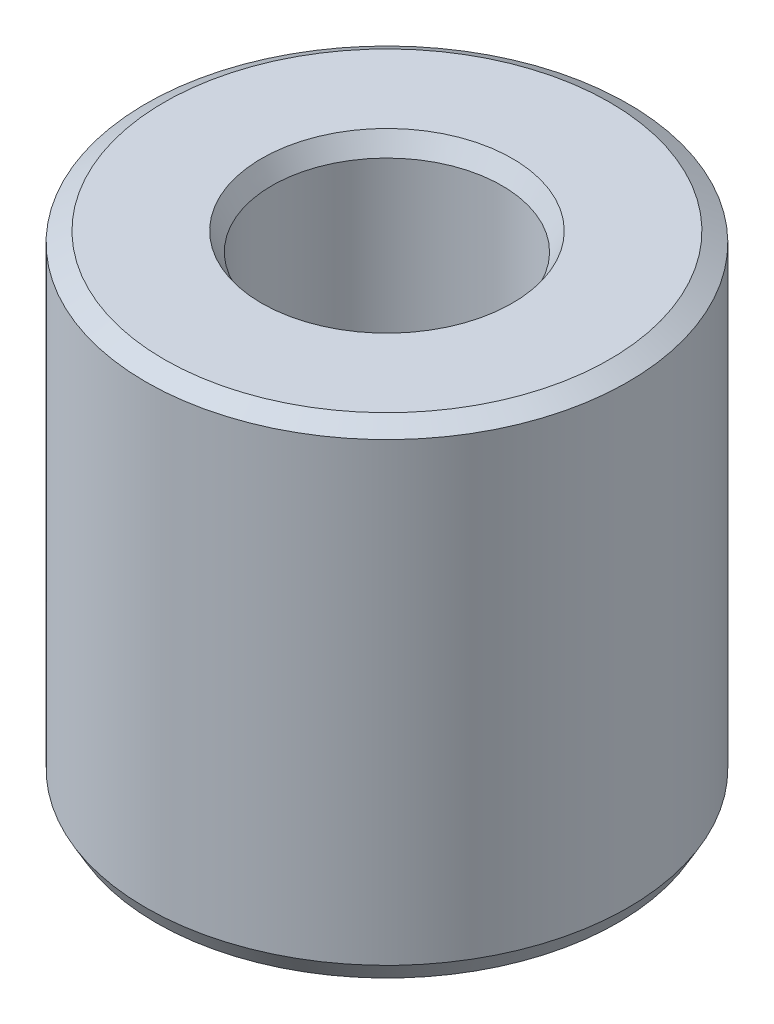
ISO-10303-21;
HEADER;
FILE_DESCRIPTION(('STEP AP214'),'2;1');
FILE_NAME('part.step','',(''),(''),'','','');
FILE_SCHEMA(('AUTOMOTIVE_DESIGN { 1 0 10303 214 1 1 1 1 }'));
ENDSEC;
DATA;
#1=APPLICATION_CONTEXT('core data for automotive mechanical design processes');
#2=APPLICATION_PROTOCOL_DEFINITION('international standard','automotive_design',2000,#1);
#3=PRODUCT_CONTEXT('',#1,'mechanical');
#4=PRODUCT('Part','Part','',(#3));
#5=PRODUCT_RELATED_PRODUCT_CATEGORY('part','',(#4));
#6=PRODUCT_DEFINITION_FORMATION('','',#4);
#7=PRODUCT_DEFINITION_CONTEXT('part definition',#1,'design');
#8=PRODUCT_DEFINITION('design','',#6,#7);
#9=PRODUCT_DEFINITION_SHAPE('','',#8);
#10=(LENGTH_UNIT() NAMED_UNIT(*) SI_UNIT(.MILLI.,.METRE.));
#11=(NAMED_UNIT(*) PLANE_ANGLE_UNIT() SI_UNIT($,.RADIAN.));
#12=(NAMED_UNIT(*) SI_UNIT($,.STERADIAN.) SOLID_ANGLE_UNIT());
#13=UNCERTAINTY_MEASURE_WITH_UNIT(LENGTH_MEASURE(1.E-05),#10,'distance_accuracy_value','');
#14=(GEOMETRIC_REPRESENTATION_CONTEXT(3) GLOBAL_UNCERTAINTY_ASSIGNED_CONTEXT((#13)) GLOBAL_UNIT_ASSIGNED_CONTEXT((#10,
#11,#12)) REPRESENTATION_CONTEXT('',''));
#15=CARTESIAN_POINT('',(0.,0.,0.));
#16=DIRECTION('',(0.,0.,1.));
#17=DIRECTION('',(1.,0.,0.));
#18=AXIS2_PLACEMENT_3D('',#15,#16,#17);
#19=CARTESIAN_POINT('',(0.,45.1801585356301,0.));
#20=DIRECTION('',(0.,-1.,0.));
#21=DIRECTION('',(0.,0.,-1.));
#22=AXIS2_PLACEMENT_3D('',#19,#20,#21);
#23=CYLINDRICAL_SURFACE('',#22,22.5);
#24=CARTESIAN_POINT('',(0.,1.7085181431995,0.));
#25=DIRECTION('',(0.,1.,0.));
#26=DIRECTION('',(0.,0.,1.));
#27=AXIS2_PLACEMENT_3D('',#24,#25,#26);
#28=CIRCLE('',#27,22.5);
#29=CARTESIAN_POINT('',(0.,1.7085181431995,22.5));
#30=VERTEX_POINT('',#29);
#31=EDGE_CURVE('E10',#30,#30,#28,.T.);
#32=ORIENTED_EDGE('',*,*,#31,.T.);
#33=EDGE_LOOP('',(#32));
#34=FACE_BOUND('',#33,.T.);
#35=CARTESIAN_POINT('',(0.,44.2113923871852,0.));
#36=DIRECTION('',(0.,1.,0.));
#37=DIRECTION('',(0.,0.,1.));
#38=AXIS2_PLACEMENT_3D('',#35,#36,#37);
#39=CIRCLE('',#38,22.5);
#40=CARTESIAN_POINT('',(0.,44.2113923871852,22.5));
#41=VERTEX_POINT('',#40);
#42=EDGE_CURVE('E50',#41,#41,#39,.F.);
#43=ORIENTED_EDGE('',*,*,#42,.T.);
#44=EDGE_LOOP('',(#43));
#45=FACE_BOUND('',#44,.T.);
#46=ADVANCED_FACE('F39',(#34,#45),#23,.T.);
#47=CARTESIAN_POINT('',(0.,45.1801585356301,0.));
#48=DIRECTION('',(0.,1.,0.));
#49=DIRECTION('',(0.,0.,1.));
#50=AXIS2_PLACEMENT_3D('',#47,#48,#49);
#51=PLANE('',#50);
#52=CARTESIAN_POINT('',(0.,45.1801585356301,0.));
#53=DIRECTION('',(0.,1.,0.));
#54=DIRECTION('',(0.,0.,1.));
#55=AXIS2_PLACEMENT_3D('',#52,#53,#54);
#56=CIRCLE('',#55,11.7046584919158);
#57=CARTESIAN_POINT('',(0.,45.1801585356301,11.7046584919158));
#58=VERTEX_POINT('',#57);
#59=EDGE_CURVE('E58',#58,#58,#56,.F.);
#60=ORIENTED_EDGE('',*,*,#59,.T.);
#61=EDGE_LOOP('',(#60));
#62=FACE_BOUND('',#61,.T.);
#63=CARTESIAN_POINT('',(0.,45.1801585356301,0.));
#64=DIRECTION('',(0.,1.,0.));
#65=DIRECTION('',(0.,0.,1.));
#66=AXIS2_PLACEMENT_3D('',#63,#64,#65);
#67=CIRCLE('',#66,20.7914818568005);
#68=CARTESIAN_POINT('',(0.,45.1801585356301,20.7914818568005));
#69=VERTEX_POINT('',#68);
#70=EDGE_CURVE('E61',#69,#69,#67,.T.);
#71=ORIENTED_EDGE('',*,*,#70,.T.);
#72=EDGE_LOOP('',(#71));
#73=FACE_BOUND('',#72,.T.);
#74=ADVANCED_FACE('F88',(#62,#73),#51,.T.);
#75=CARTESIAN_POINT('',(0.,0.,0.));
#76=DIRECTION('',(0.,1.,0.));
#77=DIRECTION('',(0.,0.,1.));
#78=AXIS2_PLACEMENT_3D('',#75,#76,#77);
#79=PLANE('',#78);
#80=CARTESIAN_POINT('',(0.,0.,0.));
#81=DIRECTION('',(0.,1.,0.));
#82=DIRECTION('',(0.,0.,1.));
#83=AXIS2_PLACEMENT_3D('',#80,#81,#82);
#84=CIRCLE('',#83,12.4444104866704);
#85=CARTESIAN_POINT('',(0.,0.,12.4444104866704));
#86=VERTEX_POINT('',#85);
#87=EDGE_CURVE('E51',#86,#86,#84,.T.);
#88=ORIENTED_EDGE('',*,*,#87,.T.);
#89=EDGE_LOOP('',(#88));
#90=FACE_BOUND('',#89,.T.);
#91=CARTESIAN_POINT('',(0.,0.,0.));
#92=DIRECTION('',(0.,1.,0.));
#93=DIRECTION('',(0.,0.,1.));
#94=AXIS2_PLACEMENT_3D('',#91,#92,#93);
#95=CIRCLE('',#94,21.5312338515551);
#96=CARTESIAN_POINT('',(0.,0.,21.5312338515551));
#97=VERTEX_POINT('',#96);
#98=EDGE_CURVE('E54',#97,#97,#95,.F.);
#99=ORIENTED_EDGE('',*,*,#98,.T.);
#100=EDGE_LOOP('',(#99));
#101=FACE_BOUND('',#100,.T.);
#102=ADVANCED_FACE('F83',(#90,#101),#79,.F.);
#103=CARTESIAN_POINT('',(0.,45.1801585356301,0.));
#104=DIRECTION('',(0.,-1.,0.));
#105=DIRECTION('',(0.,0.,-1.));
#106=AXIS2_PLACEMENT_3D('',#103,#104,#105);
#107=CYLINDRICAL_SURFACE('',#106,10.735892343471);
#108=CARTESIAN_POINT('',(0.,43.4716403924306,0.));
#109=DIRECTION('',(0.,1.,0.));
#110=DIRECTION('',(0.,0.,1.));
#111=AXIS2_PLACEMENT_3D('',#108,#109,#110);
#112=CIRCLE('',#111,10.735892343471);
#113=CARTESIAN_POINT('',(0.,43.4716403924306,10.735892343471));
#114=VERTEX_POINT('',#113);
#115=EDGE_CURVE('E67',#114,#114,#112,.T.);
#116=ORIENTED_EDGE('',*,*,#115,.T.);
#117=EDGE_LOOP('',(#116));
#118=FACE_BOUND('',#117,.T.);
#119=CARTESIAN_POINT('',(0.,0.968766148444877,0.));
#120=DIRECTION('',(0.,1.,0.));
#121=DIRECTION('',(0.,0.,1.));
#122=AXIS2_PLACEMENT_3D('',#119,#120,#121);
#123=CIRCLE('',#122,10.735892343471);
#124=CARTESIAN_POINT('',(0.,0.968766148444877,10.735892343471));
#125=VERTEX_POINT('',#124);
#126=EDGE_CURVE('E69',#125,#125,#123,.F.);
#127=ORIENTED_EDGE('',*,*,#126,.T.);
#128=EDGE_LOOP('',(#127));
#129=FACE_BOUND('',#128,.T.);
#130=ADVANCED_FACE('F71',(#118,#129),#107,.F.);
#131=CARTESIAN_POINT('',(0.,43.4716403924306,0.));
#132=DIRECTION('',(0.,1.,0.));
#133=DIRECTION('',(0.,0.,1.));
#134=AXIS2_PLACEMENT_3D('',#131,#132,#133);
#135=CONICAL_SURFACE('',#134,10.735892343471,0.515817388916927);
#136=ORIENTED_EDGE('',*,*,#59,.F.);
#137=EDGE_LOOP('',(#136));
#138=FACE_BOUND('',#137,.T.);
#139=ORIENTED_EDGE('',*,*,#115,.F.);
#140=EDGE_LOOP('',(#139));
#141=FACE_BOUND('',#140,.T.);
#142=ADVANCED_FACE('F77',(#138,#141),#135,.F.);
#143=CARTESIAN_POINT('',(0.,0.,0.));
#144=DIRECTION('',(0.,-1.,0.));
#145=DIRECTION('',(0.,0.,-1.));
#146=AXIS2_PLACEMENT_3D('',#143,#144,#145);
#147=CONICAL_SURFACE('',#146,12.4444104866704,1.05497893787797);
#148=ORIENTED_EDGE('',*,*,#126,.F.);
#149=EDGE_LOOP('',(#148));
#150=FACE_BOUND('',#149,.T.);
#151=ORIENTED_EDGE('',*,*,#87,.F.);
#152=EDGE_LOOP('',(#151));
#153=FACE_BOUND('',#152,.T.);
#154=ADVANCED_FACE('F73',(#150,#153),#147,.F.);
#155=CARTESIAN_POINT('',(0.,1.7085181431995,0.));
#156=DIRECTION('',(0.,1.,0.));
#157=DIRECTION('',(0.,0.,1.));
#158=AXIS2_PLACEMENT_3D('',#155,#156,#157);
#159=CONICAL_SURFACE('',#158,22.5,0.515817388916931);
#160=CARTESIAN_POINT('',(0.,0.,21.5312338515551));
#161=CARTESIAN_POINT('',(0.,0.0177970639916613,21.5413251656014));
#162=CARTESIAN_POINT('',(0.,0.0355941279833228,21.5514164796477));
#163=CARTESIAN_POINT('',(0.,0.0711882559666456,21.5715991077403));
#164=CARTESIAN_POINT('',(0.,0.088985319958307,21.5816904217866));
#165=CARTESIAN_POINT('',(0.,0.12457944794163,21.6018730498792));
#166=CARTESIAN_POINT('',(0.,0.142376511933292,21.6119643639255));
#167=CARTESIAN_POINT('',(0.,0.177970639916615,21.6321469920181));
#168=CARTESIAN_POINT('',(0.,0.195767703908276,21.6422383060644));
#169=CARTESIAN_POINT('',(0.,0.231361831891598,21.662420934157));
#170=CARTESIAN_POINT('',(0.,0.24915889588326,21.6725122482033));
#171=CARTESIAN_POINT('',(0.,0.284753023866583,21.6926948762959));
#172=CARTESIAN_POINT('',(0.,0.302550087858245,21.7027861903422));
#173=CARTESIAN_POINT('',(0.,0.338144215841567,21.7229688184348));
#174=CARTESIAN_POINT('',(0.,0.355941279833229,21.7330601324811));
#175=CARTESIAN_POINT('',(0.,0.391535407816552,21.7532427605737));
#176=CARTESIAN_POINT('',(0.,0.409332471808213,21.76333407462));
#177=CARTESIAN_POINT('',(0.,0.444926599791536,21.7835167027126));
#178=CARTESIAN_POINT('',(0.,0.462723663783198,21.7936080167589));
#179=CARTESIAN_POINT('',(0.,0.498317791766521,21.8137906448515));
#180=CARTESIAN_POINT('',(0.,0.516114855758182,21.8238819588978));
#181=CARTESIAN_POINT('',(0.,0.551708983741505,21.8440645869904));
#182=CARTESIAN_POINT('',(0.,0.569506047733166,21.8541559010367));
#183=CARTESIAN_POINT('',(0.,0.605100175716489,21.8743385291293));
#184=CARTESIAN_POINT('',(0.,0.622897239708151,21.8844298431756));
#185=CARTESIAN_POINT('',(0.,0.658491367691474,21.9046124712682));
#186=CARTESIAN_POINT('',(0.,0.676288431683135,21.9147037853145));
#187=CARTESIAN_POINT('',(0.,0.711882559666458,21.9348864134071));
#188=CARTESIAN_POINT('',(0.,0.72967962365812,21.9449777274534));
#189=CARTESIAN_POINT('',(0.,0.765273751641443,21.965160355546));
#190=CARTESIAN_POINT('',(0.,0.783070815633104,21.9752516695924));
#191=CARTESIAN_POINT('',(0.,0.818664943616427,21.995434297685));
#192=CARTESIAN_POINT('',(0.,0.836462007608089,22.0055256117313));
#193=CARTESIAN_POINT('',(0.,0.872056135591411,22.0257082398239));
#194=CARTESIAN_POINT('',(0.,0.889853199583073,22.0357995538702));
#195=CARTESIAN_POINT('',(0.,0.925447327566395,22.0559821819628));
#196=CARTESIAN_POINT('',(0.,0.943244391558057,22.0660734960091));
#197=CARTESIAN_POINT('',(0.,0.97883851954138,22.0862561241017));
#198=CARTESIAN_POINT('',(0.,0.996635583533042,22.096347438148));
#199=CARTESIAN_POINT('',(0.,1.03222971151636,22.1165300662406));
#200=CARTESIAN_POINT('',(0.,1.05002677550803,22.1266213802869));
#201=CARTESIAN_POINT('',(0.,1.08562090349135,22.1468040083795));
#202=CARTESIAN_POINT('',(0.,1.10341796748301,22.1568953224258));
#203=CARTESIAN_POINT('',(0.,1.13901209546633,22.1770779505184));
#204=CARTESIAN_POINT('',(0.,1.156809159458,22.1871692645647));
#205=CARTESIAN_POINT('',(0.,1.19240328744132,22.2073518926573));
#206=CARTESIAN_POINT('',(0.,1.21020035143298,22.2174432067036));
#207=CARTESIAN_POINT('',(0.,1.2457944794163,22.2376258347962));
#208=CARTESIAN_POINT('',(0.,1.26359154340796,22.2477171488425));
#209=CARTESIAN_POINT('',(0.,1.29918567139129,22.2678997769351));
#210=CARTESIAN_POINT('',(0.,1.31698273538295,22.2779910909814));
#211=CARTESIAN_POINT('',(0.,1.35257686336627,22.298173719074));
#212=CARTESIAN_POINT('',(0.,1.37037392735793,22.3082650331203));
#213=CARTESIAN_POINT('',(0.,1.40596805534126,22.3284476612129));
#214=CARTESIAN_POINT('',(0.,1.42376511933292,22.3385389752592));
#215=CARTESIAN_POINT('',(0.,1.45935924731624,22.3587216033518));
#216=CARTESIAN_POINT('',(0.,1.4771563113079,22.3688129173981));
#217=CARTESIAN_POINT('',(0.,1.51275043929122,22.3889955454907));
#218=CARTESIAN_POINT('',(0.,1.53054750328289,22.399086859537));
#219=CARTESIAN_POINT('',(0.,1.56614163126621,22.4192694876296));
#220=CARTESIAN_POINT('',(0.,1.58393869525787,22.4293608016759));
#221=CARTESIAN_POINT('',(0.,1.61953282324119,22.4495434297685));
#222=CARTESIAN_POINT('',(0.,1.63732988723285,22.4596347438148));
#223=CARTESIAN_POINT('',(0.,1.67292401521618,22.4798173719074));
#224=CARTESIAN_POINT('',(0.,1.69072107920784,22.4899086859537));
#225=CARTESIAN_POINT('',(0.,1.7085181431995,22.5));
#226=B_SPLINE_CURVE_WITH_KNOTS('',3,(#160,#161,#162,#163,#164,#165,#166,#167,#168,#169,#170,
#171,#172,#173,#174,#175,#176,#177,#178,#179,#180,#181,#182,#183,#184,#185,#186,#187,#188,#189,
#190,#191,#192,#193,#194,#195,#196,#197,#198,#199,#200,#201,#202,#203,#204,#205,#206,#207,#208,
#209,#210,#211,#212,#213,#214,#215,#216,#217,#218,#219,#220,#221,#222,#223,#224,#225),
.UNSPECIFIED.,.F.,.F.,(4,2,2,2,2,2,2,2,2,2,2,2,2,2,2,2,2,2,2,2,2,2,2,2,2,2,2,2,2,2,2,2,4),(0.,
0.0613769578354878,0.122753915670976,0.184130873506463,0.245507831341953,0.306884789177441,
0.368261747012929,0.429638704848416,0.491015662683904,0.552392620519392,0.61376957835488,
0.675146536190369,0.736523494025857,0.797900451861345,0.859277409696833,0.920654367532321,
0.982031325367808,1.0434082832033,1.10478524103879,1.16616219887427,1.22753915670976,
1.28891611454525,1.35029307238074,1.41167003021623,1.47304698805171,1.5344239458872,
1.59580090372269,1.65717786155818,1.71855481939366,1.77993177722915,1.84130873506464,
1.90268569290013,1.96406265073562),.UNSPECIFIED.);
#227=EDGE_CURVE('BSEAM76',#97,#30,#226,.T.);
#228=ORIENTED_EDGE('',*,*,#98,.F.);
#229=ORIENTED_EDGE('',*,*,#31,.F.);
#230=ORIENTED_EDGE('',*,*,#227,.T.);
#231=ORIENTED_EDGE('',*,*,#227,.F.);
#232=EDGE_LOOP('',(#228,#230,#229,#231));
#233=FACE_BOUND('',#232,.T.);
#234=ADVANCED_FACE('F76',(#233),#159,.T.);
#235=CARTESIAN_POINT('',(0.,45.1801585356301,0.));
#236=DIRECTION('',(0.,-1.,0.));
#237=DIRECTION('',(0.,0.,-1.));
#238=AXIS2_PLACEMENT_3D('',#235,#236,#237);
#239=CONICAL_SURFACE('',#238,20.7914818568005,1.05497893787797);
#240=ORIENTED_EDGE('',*,*,#42,.F.);
#241=EDGE_LOOP('',(#240));
#242=FACE_BOUND('',#241,.T.);
#243=ORIENTED_EDGE('',*,*,#70,.F.);
#244=EDGE_LOOP('',(#243));
#245=FACE_BOUND('',#244,.T.);
#246=ADVANCED_FACE('F45',(#242,#245),#239,.T.);
#247=CLOSED_SHELL('',(#46,#74,#102,#130,#142,#154,#234,#246));
#248=MANIFOLD_SOLID_BREP('B2',#247);
#249=ADVANCED_BREP_SHAPE_REPRESENTATION('',(#18,#248),#14);
#250=SHAPE_DEFINITION_REPRESENTATION(#9,#249);
ENDSEC;
END-ISO-10303-21;
